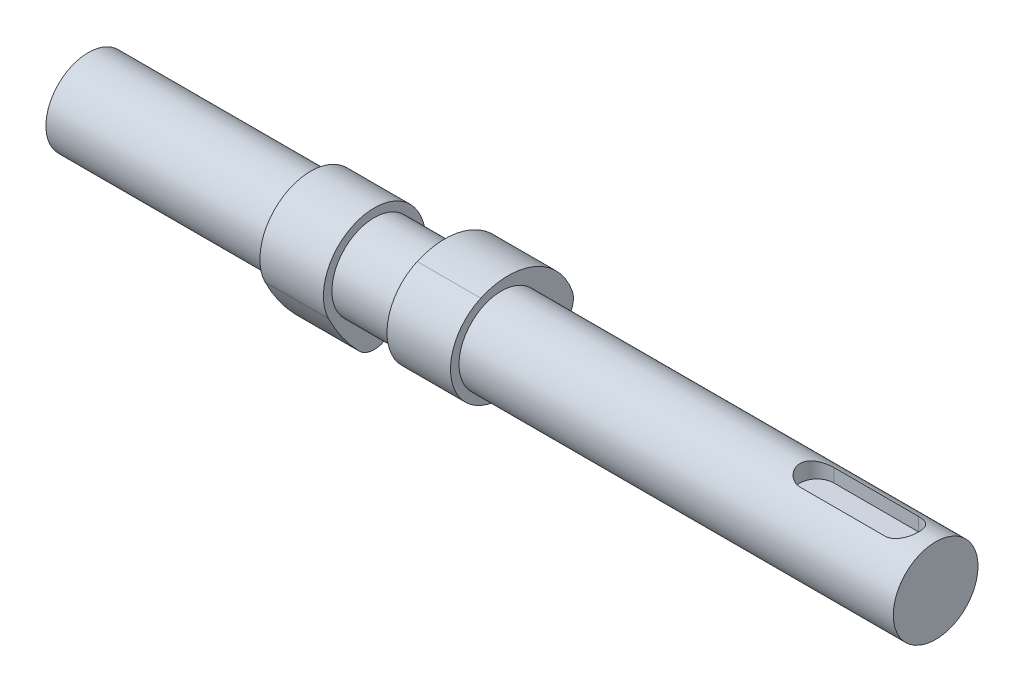
ISO-10303-21;
HEADER;
FILE_DESCRIPTION(('STEP AP214'),'2;1');
FILE_NAME('part.step','',(''),(''),'','','');
FILE_SCHEMA(('AUTOMOTIVE_DESIGN { 1 0 10303 214 1 1 1 1 }'));
ENDSEC;
DATA;
#1=APPLICATION_CONTEXT('core data for automotive mechanical design processes');
#2=APPLICATION_PROTOCOL_DEFINITION('international standard','automotive_design',2000,#1);
#3=PRODUCT_CONTEXT('',#1,'mechanical');
#4=PRODUCT('Part','Part','',(#3));
#5=PRODUCT_RELATED_PRODUCT_CATEGORY('part','',(#4));
#6=PRODUCT_DEFINITION_FORMATION('','',#4);
#7=PRODUCT_DEFINITION_CONTEXT('part definition',#1,'design');
#8=PRODUCT_DEFINITION('design','',#6,#7);
#9=PRODUCT_DEFINITION_SHAPE('','',#8);
#10=(LENGTH_UNIT() NAMED_UNIT(*) SI_UNIT(.MILLI.,.METRE.));
#11=(NAMED_UNIT(*) PLANE_ANGLE_UNIT() SI_UNIT($,.RADIAN.));
#12=(NAMED_UNIT(*) SI_UNIT($,.STERADIAN.) SOLID_ANGLE_UNIT());
#13=UNCERTAINTY_MEASURE_WITH_UNIT(LENGTH_MEASURE(1.E-05),#10,'distance_accuracy_value','');
#14=(GEOMETRIC_REPRESENTATION_CONTEXT(3) GLOBAL_UNCERTAINTY_ASSIGNED_CONTEXT((#13)) GLOBAL_UNIT_ASSIGNED_CONTEXT((#10,
#11,#12)) REPRESENTATION_CONTEXT('',''));
#15=CARTESIAN_POINT('',(0.,0.,0.));
#16=DIRECTION('',(0.,0.,1.));
#17=DIRECTION('',(1.,0.,0.));
#18=AXIS2_PLACEMENT_3D('',#15,#16,#17);
#19=CARTESIAN_POINT('',(-22.5,-1.62236318948022,3.65621904177246));
#20=DIRECTION('',(1.,0.,0.));
#21=DIRECTION('',(0.,1.,0.));
#22=AXIS2_PLACEMENT_3D('',#19,#20,#21);
#23=CYLINDRICAL_SURFACE('',#22,16.);
#24=CARTESIAN_POINT('',(-7.5,-1.62236318948022,3.65621904177246));
#25=DIRECTION('',(1.,0.,0.));
#26=DIRECTION('',(0.,1.,0.));
#27=AXIS2_PLACEMENT_3D('',#24,#25,#26);
#28=CIRCLE('',#27,16.);
#29=CARTESIAN_POINT('',(-7.5,-16.7126720366766,-1.66191774626015));
#30=VERTEX_POINT('',#29);
#31=CARTESIAN_POINT('',(-7.5,4.86708956844067,-10.9686571253174));
#32=VERTEX_POINT('',#31);
#33=EDGE_CURVE('E115',#30,#32,#28,.T.);
#34=ORIENTED_EDGE('',*,*,#33,.F.);
#35=DIRECTION('',(1.,0.,0.));
#36=VECTOR('',#35,1.);
#37=CARTESIAN_POINT('',(-22.5,-16.7126720366766,-1.66191774626015));
#38=LINE('',#37,#36);
#39=CARTESIAN_POINT('',(-22.5,-16.7126720366766,-1.66191774626015));
#40=VERTEX_POINT('',#39);
#41=EDGE_CURVE('E114',#40,#30,#38,.T.);
#42=ORIENTED_EDGE('',*,*,#41,.F.);
#43=CARTESIAN_POINT('',(-22.5,-1.62236318948022,3.65621904177246));
#44=DIRECTION('',(1.,0.,0.));
#45=DIRECTION('',(0.,1.,0.));
#46=AXIS2_PLACEMENT_3D('',#43,#44,#45);
#47=CIRCLE('',#46,16.);
#48=CARTESIAN_POINT('',(-22.5,4.86708956844067,-10.9686571253174));
#49=VERTEX_POINT('',#48);
#50=EDGE_CURVE('E109',#40,#49,#47,.T.);
#51=ORIENTED_EDGE('',*,*,#50,.T.);
#52=DIRECTION('',(1.,0.,0.));
#53=VECTOR('',#52,1.);
#54=CARTESIAN_POINT('',(-22.5,4.86708956844067,-10.9686571253174));
#55=LINE('',#54,#53);
#56=EDGE_CURVE('E12',#49,#32,#55,.T.);
#57=ORIENTED_EDGE('',*,*,#56,.T.);
#58=EDGE_LOOP('',(#34,#42,#51,#57));
#59=FACE_BOUND('',#58,.T.);
#60=ADVANCED_FACE('F52',(#59),#23,.T.);
#61=CARTESIAN_POINT('',(-22.5,0.,0.));
#62=DIRECTION('',(1.,0.,0.));
#63=DIRECTION('',(0.,1.,0.));
#64=AXIS2_PLACEMENT_3D('',#61,#62,#63);
#65=CYLINDRICAL_SURFACE('',#64,12.);
#66=CARTESIAN_POINT('',(-7.5,0.,0.));
#67=DIRECTION('',(1.,0.,0.));
#68=DIRECTION('',(0.,-1.,0.));
#69=AXIS2_PLACEMENT_3D('',#66,#67,#68);
#70=CIRCLE('',#69,12.);
#71=CARTESIAN_POINT('',(-7.5,-5.30622661682885,10.7630831591537));
#72=VERTEX_POINT('',#71);
#73=EDGE_CURVE('E117',#32,#72,#70,.T.);
#74=ORIENTED_EDGE('',*,*,#73,.F.);
#75=ORIENTED_EDGE('',*,*,#56,.F.);
#76=CARTESIAN_POINT('',(-22.5,0.,0.));
#77=DIRECTION('',(1.,0.,0.));
#78=DIRECTION('',(0.,-1.,0.));
#79=AXIS2_PLACEMENT_3D('',#76,#77,#78);
#80=CIRCLE('',#79,12.);
#81=CARTESIAN_POINT('',(-22.5,-5.30622661682885,10.7630831591537));
#82=VERTEX_POINT('',#81);
#83=EDGE_CURVE('E93',#49,#82,#80,.T.);
#84=ORIENTED_EDGE('',*,*,#83,.T.);
#85=DIRECTION('',(1.,0.,0.));
#86=VECTOR('',#85,1.);
#87=CARTESIAN_POINT('',(-22.5,-5.30622661682885,10.7630831591537));
#88=LINE('',#87,#86);
#89=EDGE_CURVE('E60',#82,#72,#88,.T.);
#90=ORIENTED_EDGE('',*,*,#89,.T.);
#91=EDGE_LOOP('',(#74,#75,#84,#90));
#92=FACE_BOUND('',#91,.T.);
#93=ADVANCED_FACE('F107',(#92),#65,.T.);
#94=CARTESIAN_POINT('',(-22.5,12.3811954392673,-25.1138607046918));
#95=DIRECTION('',(1.,0.,0.));
#96=DIRECTION('',(0.,1.,0.));
#97=AXIS2_PLACEMENT_3D('',#94,#95,#96);
#98=CYLINDRICAL_SURFACE('',#97,40.);
#99=CARTESIAN_POINT('',(-7.5,12.3811954392673,-25.1138607046918));
#100=DIRECTION('',(1.,0.,0.));
#101=DIRECTION('',(0.,-1.,0.));
#102=AXIS2_PLACEMENT_3D('',#99,#100,#101);
#103=CIRCLE('',#102,40.);
#104=CARTESIAN_POINT('',(-7.5,-15.4795428020985,3.58769438638461));
#105=VERTEX_POINT('',#104);
#106=EDGE_CURVE('E103',#72,#105,#103,.T.);
#107=ORIENTED_EDGE('',*,*,#106,.F.);
#108=ORIENTED_EDGE('',*,*,#89,.F.);
#109=CARTESIAN_POINT('',(-22.5,12.3811954392673,-25.1138607046918));
#110=DIRECTION('',(1.,0.,0.));
#111=DIRECTION('',(0.,-1.,0.));
#112=AXIS2_PLACEMENT_3D('',#109,#110,#111);
#113=CIRCLE('',#112,40.);
#114=CARTESIAN_POINT('',(-22.5,-15.4795428020985,3.58769438638461));
#115=VERTEX_POINT('',#114);
#116=EDGE_CURVE('E96',#82,#115,#113,.T.);
#117=ORIENTED_EDGE('',*,*,#116,.T.);
#118=DIRECTION('',(1.,0.,0.));
#119=VECTOR('',#118,1.);
#120=CARTESIAN_POINT('',(-22.5,-15.4795428020985,3.58769438638461));
#121=LINE('',#120,#119);
#122=EDGE_CURVE('E106',#115,#105,#121,.T.);
#123=ORIENTED_EDGE('',*,*,#122,.T.);
#124=EDGE_LOOP('',(#107,#108,#117,#123));
#125=FACE_BOUND('',#124,.T.);
#126=ADVANCED_FACE('F102',(#125),#98,.T.);
#127=CARTESIAN_POINT('',(-22.5,-11.9969505219278,0.));
#128=DIRECTION('',(1.,0.,0.));
#129=DIRECTION('',(0.,1.,0.));
#130=AXIS2_PLACEMENT_3D('',#127,#128,#129);
#131=CYLINDRICAL_SURFACE('',#130,5.);
#132=CARTESIAN_POINT('',(-7.5,-11.9969505219278,0.));
#133=DIRECTION('',(1.,0.,0.));
#134=DIRECTION('',(0.,-1.,0.));
#135=AXIS2_PLACEMENT_3D('',#132,#133,#134);
#136=CIRCLE('',#135,5.);
#137=EDGE_CURVE('E82',#105,#30,#136,.T.);
#138=ORIENTED_EDGE('',*,*,#137,.F.);
#139=ORIENTED_EDGE('',*,*,#122,.F.);
#140=CARTESIAN_POINT('',(-22.5,-11.9969505219278,0.));
#141=DIRECTION('',(1.,0.,0.));
#142=DIRECTION('',(0.,-1.,0.));
#143=AXIS2_PLACEMENT_3D('',#140,#141,#142);
#144=CIRCLE('',#143,5.);
#145=EDGE_CURVE('E68',#115,#40,#144,.T.);
#146=ORIENTED_EDGE('',*,*,#145,.T.);
#147=ORIENTED_EDGE('',*,*,#41,.T.);
#148=EDGE_LOOP('',(#138,#139,#146,#147));
#149=FACE_BOUND('',#148,.T.);
#150=ADVANCED_FACE('F126',(#149),#131,.T.);
#151=CARTESIAN_POINT('',(-22.5,-6.80965685570399,1.82810952088625));
#152=DIRECTION('',(1.,0.,0.));
#153=DIRECTION('',(0.,1.,0.));
#154=AXIS2_PLACEMENT_3D('',#151,#152,#153);
#155=PLANE('',#154);
#156=ORIENTED_EDGE('',*,*,#50,.F.);
#157=ORIENTED_EDGE('',*,*,#145,.F.);
#158=ORIENTED_EDGE('',*,*,#116,.F.);
#159=ORIENTED_EDGE('',*,*,#83,.F.);
#160=EDGE_LOOP('',(#156,#157,#158,#159));
#161=FACE_BOUND('',#160,.T.);
#162=ADVANCED_FACE('F98',(#161),#155,.F.);
#163=CARTESIAN_POINT('',(-7.5,-6.80965685570399,1.82810952088625));
#164=DIRECTION('',(1.,0.,0.));
#165=DIRECTION('',(0.,1.,0.));
#166=AXIS2_PLACEMENT_3D('',#163,#164,#165);
#167=PLANE('',#166);
#168=ORIENTED_EDGE('',*,*,#33,.T.);
#169=ORIENTED_EDGE('',*,*,#73,.T.);
#170=ORIENTED_EDGE('',*,*,#106,.T.);
#171=ORIENTED_EDGE('',*,*,#137,.T.);
#172=EDGE_LOOP('',(#168,#169,#170,#171));
#173=FACE_BOUND('',#172,.T.);
#174=ADVANCED_FACE('F122',(#173),#167,.T.);
#175=CLOSED_SHELL('',(#60,#93,#126,#150,#162,#174));
#176=MANIFOLD_SOLID_BREP('B2',#175);
#177=CARTESIAN_POINT('',(22.5,-3.65621904177246,-1.62236318948023));
#178=DIRECTION('',(-1.,0.,0.));
#179=DIRECTION('',(0.,0.,1.));
#180=AXIS2_PLACEMENT_3D('',#177,#178,#179);
#181=CYLINDRICAL_SURFACE('',#180,16.);
#182=CARTESIAN_POINT('',(7.5,-3.65621904177246,-1.62236318948023));
#183=DIRECTION('',(1.,0.,0.));
#184=DIRECTION('',(0.,0.,1.));
#185=AXIS2_PLACEMENT_3D('',#182,#183,#184);
#186=CIRCLE('',#185,16.);
#187=CARTESIAN_POINT('',(7.5,1.66191774626021,-16.7126720366766));
#188=VERTEX_POINT('',#187);
#189=CARTESIAN_POINT('',(7.5,10.9686571253174,4.8670895684407));
#190=VERTEX_POINT('',#189);
#191=EDGE_CURVE('E248',#188,#190,#186,.T.);
#192=ORIENTED_EDGE('',*,*,#191,.T.);
#193=DIRECTION('',(-1.,0.,0.));
#194=VECTOR('',#193,1.);
#195=CARTESIAN_POINT('',(22.5,10.9686571253174,4.8670895684407));
#196=LINE('',#195,#194);
#197=CARTESIAN_POINT('',(22.5,10.9686571253174,4.8670895684407));
#198=VERTEX_POINT('',#197);
#199=EDGE_CURVE('E50',#198,#190,#196,.T.);
#200=ORIENTED_EDGE('',*,*,#199,.F.);
#201=CARTESIAN_POINT('',(22.5,-3.65621904177246,-1.62236318948023));
#202=DIRECTION('',(1.,0.,0.));
#203=DIRECTION('',(0.,0.,1.));
#204=AXIS2_PLACEMENT_3D('',#201,#202,#203);
#205=CIRCLE('',#204,16.);
#206=CARTESIAN_POINT('',(22.5,1.66191774626021,-16.7126720366766));
#207=VERTEX_POINT('',#206);
#208=EDGE_CURVE('E236',#207,#198,#205,.T.);
#209=ORIENTED_EDGE('',*,*,#208,.F.);
#210=DIRECTION('',(-1.,0.,0.));
#211=VECTOR('',#210,1.);
#212=CARTESIAN_POINT('',(22.5,1.66191774626021,-16.7126720366766));
#213=LINE('',#212,#211);
#214=EDGE_CURVE('E244',#207,#188,#213,.T.);
#215=ORIENTED_EDGE('',*,*,#214,.T.);
#216=EDGE_LOOP('',(#192,#200,#209,#215));
#217=FACE_BOUND('',#216,.T.);
#218=ADVANCED_FACE('F185',(#217),#181,.T.);
#219=CARTESIAN_POINT('',(22.5,0.,0.));
#220=DIRECTION('',(-1.,0.,0.));
#221=DIRECTION('',(0.,0.,1.));
#222=AXIS2_PLACEMENT_3D('',#219,#220,#221);
#223=CYLINDRICAL_SURFACE('',#222,12.);
#224=CARTESIAN_POINT('',(7.5,0.,0.));
#225=DIRECTION('',(1.,0.,0.));
#226=DIRECTION('',(0.,0.,-1.));
#227=AXIS2_PLACEMENT_3D('',#224,#225,#226);
#228=CIRCLE('',#227,12.);
#229=CARTESIAN_POINT('',(7.5,-10.7630831591536,-5.30622661682889));
#230=VERTEX_POINT('',#229);
#231=EDGE_CURVE('E240',#190,#230,#228,.T.);
#232=ORIENTED_EDGE('',*,*,#231,.T.);
#233=DIRECTION('',(-1.,0.,0.));
#234=VECTOR('',#233,1.);
#235=CARTESIAN_POINT('',(22.5,-10.7630831591536,-5.30622661682889));
#236=LINE('',#235,#234);
#237=CARTESIAN_POINT('',(22.5,-10.7630831591536,-5.30622661682889));
#238=VERTEX_POINT('',#237);
#239=EDGE_CURVE('E193',#238,#230,#236,.T.);
#240=ORIENTED_EDGE('',*,*,#239,.F.);
#241=CARTESIAN_POINT('',(22.5,0.,0.));
#242=DIRECTION('',(1.,0.,0.));
#243=DIRECTION('',(0.,0.,-1.));
#244=AXIS2_PLACEMENT_3D('',#241,#242,#243);
#245=CIRCLE('',#244,12.);
#246=EDGE_CURVE('E231',#198,#238,#245,.T.);
#247=ORIENTED_EDGE('',*,*,#246,.F.);
#248=ORIENTED_EDGE('',*,*,#199,.T.);
#249=EDGE_LOOP('',(#232,#240,#247,#248));
#250=FACE_BOUND('',#249,.T.);
#251=ADVANCED_FACE('F239',(#250),#223,.T.);
#252=CARTESIAN_POINT('',(22.5,25.1138607046918,12.3811954392674));
#253=DIRECTION('',(-1.,0.,0.));
#254=DIRECTION('',(0.,0.,1.));
#255=AXIS2_PLACEMENT_3D('',#252,#253,#254);
#256=CYLINDRICAL_SURFACE('',#255,40.);
#257=CARTESIAN_POINT('',(7.5,25.1138607046918,12.3811954392674));
#258=DIRECTION('',(1.,0.,0.));
#259=DIRECTION('',(0.,0.,-1.));
#260=AXIS2_PLACEMENT_3D('',#257,#258,#259);
#261=CIRCLE('',#260,40.);
#262=CARTESIAN_POINT('',(7.5,-3.58769438638456,-15.4795428020985));
#263=VERTEX_POINT('',#262);
#264=EDGE_CURVE('E218',#230,#263,#261,.T.);
#265=ORIENTED_EDGE('',*,*,#264,.T.);
#266=DIRECTION('',(-1.,0.,0.));
#267=VECTOR('',#266,1.);
#268=CARTESIAN_POINT('',(22.5,-3.58769438638456,-15.4795428020985));
#269=LINE('',#268,#267);
#270=CARTESIAN_POINT('',(22.5,-3.58769438638456,-15.4795428020985));
#271=VERTEX_POINT('',#270);
#272=EDGE_CURVE('E241',#271,#263,#269,.T.);
#273=ORIENTED_EDGE('',*,*,#272,.F.);
#274=CARTESIAN_POINT('',(22.5,25.1138607046918,12.3811954392674));
#275=DIRECTION('',(1.,0.,0.));
#276=DIRECTION('',(0.,0.,-1.));
#277=AXIS2_PLACEMENT_3D('',#274,#275,#276);
#278=CIRCLE('',#277,40.);
#279=EDGE_CURVE('E234',#238,#271,#278,.T.);
#280=ORIENTED_EDGE('',*,*,#279,.F.);
#281=ORIENTED_EDGE('',*,*,#239,.T.);
#282=EDGE_LOOP('',(#265,#273,#280,#281));
#283=FACE_BOUND('',#282,.T.);
#284=ADVANCED_FACE('F242',(#283),#256,.T.);
#285=CARTESIAN_POINT('',(22.5,0.,-11.9969505219278));
#286=DIRECTION('',(-1.,0.,0.));
#287=DIRECTION('',(0.,0.,1.));
#288=AXIS2_PLACEMENT_3D('',#285,#286,#287);
#289=CYLINDRICAL_SURFACE('',#288,5.);
#290=CARTESIAN_POINT('',(7.5,0.,-11.9969505219278));
#291=DIRECTION('',(1.,0.,0.));
#292=DIRECTION('',(0.,0.,-1.));
#293=AXIS2_PLACEMENT_3D('',#290,#291,#292);
#294=CIRCLE('',#293,5.);
#295=EDGE_CURVE('E224',#263,#188,#294,.T.);
#296=ORIENTED_EDGE('',*,*,#295,.T.);
#297=ORIENTED_EDGE('',*,*,#214,.F.);
#298=CARTESIAN_POINT('',(22.5,0.,-11.9969505219278));
#299=DIRECTION('',(1.,0.,0.));
#300=DIRECTION('',(0.,0.,-1.));
#301=AXIS2_PLACEMENT_3D('',#298,#299,#300);
#302=CIRCLE('',#301,5.);
#303=EDGE_CURVE('E201',#271,#207,#302,.T.);
#304=ORIENTED_EDGE('',*,*,#303,.F.);
#305=ORIENTED_EDGE('',*,*,#272,.T.);
#306=EDGE_LOOP('',(#296,#297,#304,#305));
#307=FACE_BOUND('',#306,.T.);
#308=ADVANCED_FACE('F255',(#307),#289,.T.);
#309=CARTESIAN_POINT('',(22.5,-1.82810952088623,-6.80965685570399));
#310=DIRECTION('',(-1.,0.,0.));
#311=DIRECTION('',(0.,0.,1.));
#312=AXIS2_PLACEMENT_3D('',#309,#310,#311);
#313=PLANE('',#312);
#314=ORIENTED_EDGE('',*,*,#208,.T.);
#315=ORIENTED_EDGE('',*,*,#246,.T.);
#316=ORIENTED_EDGE('',*,*,#279,.T.);
#317=ORIENTED_EDGE('',*,*,#303,.T.);
#318=EDGE_LOOP('',(#314,#315,#316,#317));
#319=FACE_BOUND('',#318,.T.);
#320=ADVANCED_FACE('F232',(#319),#313,.F.);
#321=CARTESIAN_POINT('',(7.5,-1.82810952088623,-6.80965685570399));
#322=DIRECTION('',(-1.,0.,0.));
#323=DIRECTION('',(0.,0.,1.));
#324=AXIS2_PLACEMENT_3D('',#321,#322,#323);
#325=PLANE('',#324);
#326=ORIENTED_EDGE('',*,*,#191,.F.);
#327=ORIENTED_EDGE('',*,*,#295,.F.);
#328=ORIENTED_EDGE('',*,*,#264,.F.);
#329=ORIENTED_EDGE('',*,*,#231,.F.);
#330=EDGE_LOOP('',(#326,#327,#328,#329));
#331=FACE_BOUND('',#330,.T.);
#332=ADVANCED_FACE('F258',(#331),#325,.T.);
#333=CLOSED_SHELL('',(#218,#251,#284,#308,#320,#332));
#334=MANIFOLD_SOLID_BREP('B6',#333);
#335=CARTESIAN_POINT('',(125.,0.,0.));
#336=DIRECTION('',(-1.,0.,0.));
#337=DIRECTION('',(0.,0.,1.));
#338=AXIS2_PLACEMENT_3D('',#335,#336,#337);
#339=CYLINDRICAL_SURFACE('',#338,10.);
#340=DIRECTION('',(-1.,0.,0.));
#341=VECTOR('',#340,1.);
#342=CARTESIAN_POINT('',(125.,9.16515138991168,4.));
#343=LINE('',#342,#341);
#344=CARTESIAN_POINT('',(117.,9.16515138991168,4.));
#345=VERTEX_POINT('',#344);
#346=CARTESIAN_POINT('',(97.,9.16515138991168,4.));
#347=VERTEX_POINT('',#346);
#348=EDGE_CURVE('E183',#345,#347,#343,.T.);
#349=ORIENTED_EDGE('',*,*,#348,.T.);
#350=CARTESIAN_POINT('',(97.,9.16515138991168,4.));
#351=CARTESIAN_POINT('',(96.8923882949458,9.16512928809544,4.00001596071938));
#352=CARTESIAN_POINT('',(96.7847886688333,9.16704612011428,3.99565782731266));
#353=CARTESIAN_POINT('',(96.5704574034612,9.17459250745478,3.9783181194646));
#354=CARTESIAN_POINT('',(96.4637254492831,9.18022064873058,3.96533982937531));
#355=CARTESIAN_POINT('',(96.2523063568937,9.19499565865171,3.93095207352899));
#356=CARTESIAN_POINT('',(96.1476128319149,9.20412861441611,3.90957593640916));
#357=CARTESIAN_POINT('',(95.9405984565681,9.22560106586818,3.85863260381273));
#358=CARTESIAN_POINT('',(95.8382777514449,9.23794075728508,3.82906490834148));
#359=CARTESIAN_POINT('',(95.5361282988375,9.2791858250141,3.72853943587112));
#360=CARTESIAN_POINT('',(95.3406915386172,9.3123489831615,3.64568978920222));
#361=CARTESIAN_POINT('',(94.9664088398381,9.38624741529469,3.45096383184147));
#362=CARTESIAN_POINT('',(94.7875788940914,9.42698987727426,3.33905992673094));
#363=CARTESIAN_POINT('',(94.441475206636,9.51401998804847,3.08263671474506));
#364=CARTESIAN_POINT('',(94.2752655660996,9.56048491272144,2.93673827988501));
#365=CARTESIAN_POINT('',(93.9689194556385,9.65225581096199,2.61939292349379));
#366=CARTESIAN_POINT('',(93.8287883384928,9.69756154495612,2.44794076987999));
#367=CARTESIAN_POINT('',(93.5731872113755,9.78406834216144,2.07601181629754));
#368=CARTESIAN_POINT('',(93.4589103805898,9.82503649102096,1.87465586655104));
#369=CARTESIAN_POINT('',(93.2663118555086,9.89607888234979,1.45364828604454));
#370=CARTESIAN_POINT('',(93.1879751552067,9.92615767032247,1.23400433637532));
#371=CARTESIAN_POINT('',(93.0733175942291,9.97076629361036,0.79393488418738));
#372=CARTESIAN_POINT('',(93.0351460866969,9.98597845290694,0.574062114869031));
#373=CARTESIAN_POINT('',(92.9959430515965,10.001606202074,0.130536855092213));
#374=CARTESIAN_POINT('',(92.9948983667482,10.0020270338048,-0.0931142682526716));
#375=CARTESIAN_POINT('',(93.0289656379282,9.98843920775428,-0.524466731987226));
#376=CARTESIAN_POINT('',(93.0620499465532,9.97523973659777,-0.732358330632746));
#377=CARTESIAN_POINT('',(93.1599870009102,9.93698538393897,-1.13934964738688));
#378=CARTESIAN_POINT('',(93.2248415445704,9.91192983148495,-1.33844886722558));
#379=CARTESIAN_POINT('',(93.3852720377719,9.85193670608706,-1.72579479688348));
#380=CARTESIAN_POINT('',(93.481296395839,9.81685584875391,-1.91383264586891));
#381=CARTESIAN_POINT('',(93.7009312637048,9.74029168639969,-2.2716159956307));
#382=CARTESIAN_POINT('',(93.8245514514378,9.69880613681324,-2.4413550479227));
#383=CARTESIAN_POINT('',(94.1052800574364,9.61043706268122,-2.7695225783069));
#384=CARTESIAN_POINT('',(94.2640530171164,9.56337795745419,-2.92647922614483));
#385=CARTESIAN_POINT('',(94.6059921366628,9.47123359153046,-3.2122147086262));
#386=CARTESIAN_POINT('',(94.7891693487996,9.42614923753061,-3.34098070594789));
#387=CARTESIAN_POINT('',(95.0816356456234,9.36326134539255,-3.51186134851388));
#388=CARTESIAN_POINT('',(95.1836718383149,9.34283170142195,-3.56571263251515));
#389=CARTESIAN_POINT('',(95.3923923024092,9.30450957703985,-3.66454761505659));
#390=CARTESIAN_POINT('',(95.4990745457273,9.28661600381593,-3.70953513634086));
#391=CARTESIAN_POINT('',(95.7162289304962,9.25400250539921,-3.79016254319007));
#392=CARTESIAN_POINT('',(95.8266961700413,9.23927864276951,-3.82581403809398));
#393=CARTESIAN_POINT('',(96.0506683681487,9.2135146773091,-3.88744848158463));
#394=CARTESIAN_POINT('',(96.1641719402125,9.20247292309662,-3.91343576505911));
#395=CARTESIAN_POINT('',(96.3974454473375,9.18417798205495,-3.95619393609845));
#396=CARTESIAN_POINT('',(96.5172941945638,9.17707470750587,-3.97260125584169));
#397=CARTESIAN_POINT('',(96.758090929137,9.16754485606458,-3.99451448409732));
#398=CARTESIAN_POINT('',(96.8790381929227,9.16511539745838,-4.0000271099601));
#399=CARTESIAN_POINT('',(97.,9.16515138991168,-4.));
#400=B_SPLINE_CURVE_WITH_KNOTS('',3,(#350,#351,#352,#353,#354,#355,#356,#357,#358,#359,#360,
#361,#362,#363,#364,#365,#366,#367,#368,#369,#370,#371,#372,#373,#374,#375,#376,#377,#378,#379,
#380,#381,#382,#383,#384,#385,#386,#387,#388,#389,#390,#391,#392,#393,#394,#395,#396,#397,#398,
#399),.UNSPECIFIED.,.F.,.F.,(4,2,2,2,2,2,2,2,2,2,2,2,2,2,2,2,2,2,2,2,2,2,2,2,4),(0.,
0.322709706217834,0.645296527806424,0.966615822543774,1.28795473422461,1.9293660035182,
2.57138869889252,3.24636095994995,3.92147161082381,4.62325717855526,5.32474946398644,
5.99227753012539,6.65956903033311,7.2893783052307,7.91922322615308,8.55856353859093,
9.19812842270037,9.87963749353246,10.5614562641081,10.9125878460839,11.2635676597187,
11.6141089352909,11.964492785171,12.3274303244848,12.6901440171997),.UNSPECIFIED.);
#401=CARTESIAN_POINT('',(97.,9.16515138991168,-4.));
#402=VERTEX_POINT('',#401);
#403=EDGE_CURVE('E395',#347,#402,#400,.T.);
#404=ORIENTED_EDGE('',*,*,#403,.T.);
#405=DIRECTION('',(-1.,0.,0.));
#406=VECTOR('',#405,1.);
#407=CARTESIAN_POINT('',(125.,9.16515138991168,-4.));
#408=LINE('',#407,#406);
#409=CARTESIAN_POINT('',(117.,9.16515138991168,-4.));
#410=VERTEX_POINT('',#409);
#411=EDGE_CURVE('E318',#402,#410,#408,.F.);
#412=ORIENTED_EDGE('',*,*,#411,.T.);
#413=CARTESIAN_POINT('',(117.,9.16515138991168,-4.));
#414=CARTESIAN_POINT('',(117.107611705054,9.16512928809544,-4.00001596071937));
#415=CARTESIAN_POINT('',(117.215211331167,9.16704612011429,-3.99565782731265));
#416=CARTESIAN_POINT('',(117.429542596539,9.17459250745478,-3.97831811946459));
#417=CARTESIAN_POINT('',(117.536274550717,9.18022064873058,-3.96533982937531));
#418=CARTESIAN_POINT('',(117.747693643106,9.19499565865171,-3.93095207352899));
#419=CARTESIAN_POINT('',(117.852387168085,9.20412861441611,-3.90957593640916));
#420=CARTESIAN_POINT('',(118.059401543432,9.22560106586818,-3.85863260381273));
#421=CARTESIAN_POINT('',(118.161722248555,9.23794075728508,-3.82906490834148));
#422=CARTESIAN_POINT('',(118.463871701162,9.2791858250141,-3.72853943587112));
#423=CARTESIAN_POINT('',(118.659308461383,9.3123489831615,-3.64568978920222));
#424=CARTESIAN_POINT('',(119.033591160162,9.38624741529469,-3.45096383184147));
#425=CARTESIAN_POINT('',(119.212421105909,9.42698987727425,-3.33905992673094));
#426=CARTESIAN_POINT('',(119.558524793364,9.51401998804847,-3.08263671474506));
#427=CARTESIAN_POINT('',(119.7247344339,9.56048491272144,-2.93673827988501));
#428=CARTESIAN_POINT('',(120.031080544362,9.65225581096199,-2.61939292349378));
#429=CARTESIAN_POINT('',(120.171211661507,9.69756154495612,-2.44794076987998));
#430=CARTESIAN_POINT('',(120.426812788624,9.78406834216145,-2.07601181629754));
#431=CARTESIAN_POINT('',(120.54108961941,9.82503649102096,-1.87465586655103));
#432=CARTESIAN_POINT('',(120.733688144491,9.89607888234979,-1.45364828604453));
#433=CARTESIAN_POINT('',(120.812024844793,9.92615767032247,-1.23400433637531));
#434=CARTESIAN_POINT('',(120.926682405771,9.97076629361036,-0.793934884187374));
#435=CARTESIAN_POINT('',(120.964853913303,9.98597845290694,-0.574062114869026));
#436=CARTESIAN_POINT('',(121.004056948403,10.001606202074,-0.130536855092209));
#437=CARTESIAN_POINT('',(121.005101633252,10.0020270338048,0.0931142682526744));
#438=CARTESIAN_POINT('',(120.971034362072,9.98843920775428,0.52446673198723));
#439=CARTESIAN_POINT('',(120.937950053447,9.97523973659777,0.732358330632752));
#440=CARTESIAN_POINT('',(120.84001299909,9.93698538393897,1.13934964738688));
#441=CARTESIAN_POINT('',(120.77515845543,9.91192983148495,1.33844886722558));
#442=CARTESIAN_POINT('',(120.614727962228,9.85193670608706,1.72579479688349));
#443=CARTESIAN_POINT('',(120.518703604161,9.81685584875391,1.91383264586892));
#444=CARTESIAN_POINT('',(120.299068736295,9.74029168639969,2.27161599563071));
#445=CARTESIAN_POINT('',(120.175448548562,9.69880613681324,2.4413550479227));
#446=CARTESIAN_POINT('',(119.894719942564,9.61043706268122,2.7695225783069));
#447=CARTESIAN_POINT('',(119.735946982884,9.56337795745419,2.92647922614483));
#448=CARTESIAN_POINT('',(119.394007863337,9.47123359153046,3.2122147086262));
#449=CARTESIAN_POINT('',(119.2108306512,9.42614923753061,3.34098070594789));
#450=CARTESIAN_POINT('',(118.918364354377,9.36326134539254,3.51186134851389));
#451=CARTESIAN_POINT('',(118.816328161685,9.34283170142194,3.56571263251515));
#452=CARTESIAN_POINT('',(118.607607697591,9.30450957703985,3.66454761505659));
#453=CARTESIAN_POINT('',(118.500925454273,9.28661600381593,3.70953513634086));
#454=CARTESIAN_POINT('',(118.283771069504,9.25400250539921,3.79016254319007));
#455=CARTESIAN_POINT('',(118.173303829959,9.23927864276951,3.82581403809398));
#456=CARTESIAN_POINT('',(117.949331631851,9.2135146773091,3.88744848158463));
#457=CARTESIAN_POINT('',(117.835828059787,9.20247292309662,3.91343576505912));
#458=CARTESIAN_POINT('',(117.602554552662,9.18417798205495,3.95619393609845));
#459=CARTESIAN_POINT('',(117.482705805436,9.17707470750587,3.9726012558417));
#460=CARTESIAN_POINT('',(117.241909070863,9.16754485606458,3.99451448409732));
#461=CARTESIAN_POINT('',(117.120961807077,9.16511539745838,4.0000271099601));
#462=CARTESIAN_POINT('',(117.,9.16515138991168,4.));
#463=B_SPLINE_CURVE_WITH_KNOTS('',3,(#413,#414,#415,#416,#417,#418,#419,#420,#421,#422,#423,
#424,#425,#426,#427,#428,#429,#430,#431,#432,#433,#434,#435,#436,#437,#438,#439,#440,#441,#442,
#443,#444,#445,#446,#447,#448,#449,#450,#451,#452,#453,#454,#455,#456,#457,#458,#459,#460,#461,
#462),.UNSPECIFIED.,.F.,.F.,(4,2,2,2,2,2,2,2,2,2,2,2,2,2,2,2,2,2,2,2,2,2,2,2,4),(0.,
0.322709706217834,0.645296527806424,0.966615822543774,1.28795473422461,1.92936600351818,
2.5713886988925,3.24636095994996,3.92147161082381,4.62325717855526,5.32474946398644,
5.99227753012539,6.65956903033311,7.2893783052307,7.91922322615308,8.55856353859093,
9.19812842270038,9.87963749353244,10.5614562641081,10.9125878460839,11.2635676597187,
11.6141089352909,11.964492785171,12.3274303244848,12.6901440171997),.UNSPECIFIED.);
#464=EDGE_CURVE('E325',#410,#345,#463,.T.);
#465=ORIENTED_EDGE('',*,*,#464,.T.);
#466=EDGE_LOOP('',(#349,#404,#412,#465));
#467=FACE_BOUND('',#466,.T.);
#468=CARTESIAN_POINT('',(125.,0.,0.));
#469=DIRECTION('',(1.,0.,0.));
#470=DIRECTION('',(0.,0.,-1.));
#471=AXIS2_PLACEMENT_3D('',#468,#469,#470);
#472=CIRCLE('',#471,10.);
#473=CARTESIAN_POINT('',(125.,0.,-10.));
#474=VERTEX_POINT('',#473);
#475=EDGE_CURVE('E391',#474,#474,#472,.T.);
#476=ORIENTED_EDGE('',*,*,#475,.F.);
#477=EDGE_LOOP('',(#476));
#478=FACE_BOUND('',#477,.T.);
#479=CARTESIAN_POINT('',(-75.,0.,0.));
#480=DIRECTION('',(1.,0.,0.));
#481=DIRECTION('',(0.,0.,-1.));
#482=AXIS2_PLACEMENT_3D('',#479,#480,#481);
#483=CIRCLE('',#482,10.);
#484=CARTESIAN_POINT('',(-75.,0.,-10.));
#485=VERTEX_POINT('',#484);
#486=EDGE_CURVE('E382',#485,#485,#483,.T.);
#487=ORIENTED_EDGE('',*,*,#486,.T.);
#488=EDGE_LOOP('',(#487));
#489=FACE_BOUND('',#488,.T.);
#490=ADVANCED_FACE('F309',(#467,#478,#489),#339,.T.);
#491=CARTESIAN_POINT('',(125.,0.,0.));
#492=DIRECTION('',(1.,0.,0.));
#493=DIRECTION('',(0.,0.,-1.));
#494=AXIS2_PLACEMENT_3D('',#491,#492,#493);
#495=PLANE('',#494);
#496=ORIENTED_EDGE('',*,*,#475,.T.);
#497=EDGE_LOOP('',(#496));
#498=FACE_BOUND('',#497,.T.);
#499=ADVANCED_FACE('F423',(#498),#495,.T.);
#500=CARTESIAN_POINT('',(-75.,0.,0.));
#501=DIRECTION('',(1.,0.,0.));
#502=DIRECTION('',(0.,0.,-1.));
#503=AXIS2_PLACEMENT_3D('',#500,#501,#502);
#504=PLANE('',#503);
#505=ORIENTED_EDGE('',*,*,#486,.F.);
#506=EDGE_LOOP('',(#505));
#507=FACE_BOUND('',#506,.T.);
#508=ADVANCED_FACE('F421',(#507),#504,.F.);
#509=CARTESIAN_POINT('',(117.,6.,0.));
#510=DIRECTION('',(0.,1.,0.));
#511=DIRECTION('',(0.,0.,1.));
#512=AXIS2_PLACEMENT_3D('',#509,#510,#511);
#513=CYLINDRICAL_SURFACE('',#512,4.);
#514=DIRECTION('',(0.,1.,0.));
#515=VECTOR('',#514,1.);
#516=CARTESIAN_POINT('',(117.,6.,-4.));
#517=LINE('',#516,#515);
#518=CARTESIAN_POINT('',(117.,6.,-4.));
#519=VERTEX_POINT('',#518);
#520=EDGE_CURVE('E348',#519,#410,#517,.T.);
#521=ORIENTED_EDGE('',*,*,#520,.F.);
#522=CARTESIAN_POINT('',(117.,6.,0.));
#523=DIRECTION('',(0.,1.,0.));
#524=DIRECTION('',(0.,0.,1.));
#525=AXIS2_PLACEMENT_3D('',#522,#523,#524);
#526=CIRCLE('',#525,4.);
#527=CARTESIAN_POINT('',(117.,6.,4.));
#528=VERTEX_POINT('',#527);
#529=EDGE_CURVE('E352',#528,#519,#526,.T.);
#530=ORIENTED_EDGE('',*,*,#529,.F.);
#531=DIRECTION('',(0.,1.,0.));
#532=VECTOR('',#531,1.);
#533=CARTESIAN_POINT('',(117.,6.,4.));
#534=LINE('',#533,#532);
#535=EDGE_CURVE('E379',#528,#345,#534,.T.);
#536=ORIENTED_EDGE('',*,*,#535,.T.);
#537=ORIENTED_EDGE('',*,*,#464,.F.);
#538=EDGE_LOOP('',(#521,#530,#536,#537));
#539=FACE_BOUND('',#538,.T.);
#540=ADVANCED_FACE('F350',(#539),#513,.F.);
#541=CARTESIAN_POINT('',(117.,6.,4.));
#542=DIRECTION('',(0.,0.,1.));
#543=DIRECTION('',(1.,0.,0.));
#544=AXIS2_PLACEMENT_3D('',#541,#542,#543);
#545=PLANE('',#544);
#546=ORIENTED_EDGE('',*,*,#535,.F.);
#547=DIRECTION('',(1.,0.,0.));
#548=VECTOR('',#547,1.);
#549=CARTESIAN_POINT('',(117.,6.,4.));
#550=LINE('',#549,#548);
#551=CARTESIAN_POINT('',(97.,6.,4.));
#552=VERTEX_POINT('',#551);
#553=EDGE_CURVE('E358',#552,#528,#550,.T.);
#554=ORIENTED_EDGE('',*,*,#553,.F.);
#555=DIRECTION('',(0.,1.,0.));
#556=VECTOR('',#555,1.);
#557=CARTESIAN_POINT('',(97.,6.,4.));
#558=LINE('',#557,#556);
#559=EDGE_CURVE('E383',#552,#347,#558,.T.);
#560=ORIENTED_EDGE('',*,*,#559,.T.);
#561=ORIENTED_EDGE('',*,*,#348,.F.);
#562=EDGE_LOOP('',(#546,#554,#560,#561));
#563=FACE_BOUND('',#562,.T.);
#564=ADVANCED_FACE('F414',(#563),#545,.F.);
#565=CARTESIAN_POINT('',(97.,6.,0.));
#566=DIRECTION('',(0.,1.,0.));
#567=DIRECTION('',(0.,0.,1.));
#568=AXIS2_PLACEMENT_3D('',#565,#566,#567);
#569=CYLINDRICAL_SURFACE('',#568,4.);
#570=ORIENTED_EDGE('',*,*,#559,.F.);
#571=CARTESIAN_POINT('',(97.,6.,0.));
#572=DIRECTION('',(0.,1.,0.));
#573=DIRECTION('',(0.,0.,1.));
#574=AXIS2_PLACEMENT_3D('',#571,#572,#573);
#575=CIRCLE('',#574,4.);
#576=CARTESIAN_POINT('',(97.,6.,-4.));
#577=VERTEX_POINT('',#576);
#578=EDGE_CURVE('E368',#577,#552,#575,.T.);
#579=ORIENTED_EDGE('',*,*,#578,.F.);
#580=DIRECTION('',(0.,1.,0.));
#581=VECTOR('',#580,1.);
#582=CARTESIAN_POINT('',(97.,6.,-4.));
#583=LINE('',#582,#581);
#584=EDGE_CURVE('E357',#577,#402,#583,.T.);
#585=ORIENTED_EDGE('',*,*,#584,.T.);
#586=ORIENTED_EDGE('',*,*,#403,.F.);
#587=EDGE_LOOP('',(#570,#579,#585,#586));
#588=FACE_BOUND('',#587,.T.);
#589=ADVANCED_FACE('F409',(#588),#569,.F.);
#590=CARTESIAN_POINT('',(117.,6.,-4.));
#591=DIRECTION('',(0.,0.,-1.));
#592=DIRECTION('',(-1.,0.,0.));
#593=AXIS2_PLACEMENT_3D('',#590,#591,#592);
#594=PLANE('',#593);
#595=ORIENTED_EDGE('',*,*,#584,.F.);
#596=DIRECTION('',(-1.,0.,0.));
#597=VECTOR('',#596,1.);
#598=CARTESIAN_POINT('',(117.,6.,-4.));
#599=LINE('',#598,#597);
#600=EDGE_CURVE('E361',#519,#577,#599,.T.);
#601=ORIENTED_EDGE('',*,*,#600,.F.);
#602=ORIENTED_EDGE('',*,*,#520,.T.);
#603=ORIENTED_EDGE('',*,*,#411,.F.);
#604=EDGE_LOOP('',(#595,#601,#602,#603));
#605=FACE_BOUND('',#604,.T.);
#606=ADVANCED_FACE('F362',(#605),#594,.F.);
#607=CARTESIAN_POINT('',(117.,6.,0.));
#608=DIRECTION('',(0.,1.,0.));
#609=DIRECTION('',(0.,0.,1.));
#610=AXIS2_PLACEMENT_3D('',#607,#608,#609);
#611=PLANE('',#610);
#612=ORIENTED_EDGE('',*,*,#529,.T.);
#613=ORIENTED_EDGE('',*,*,#600,.T.);
#614=ORIENTED_EDGE('',*,*,#578,.T.);
#615=ORIENTED_EDGE('',*,*,#553,.T.);
#616=EDGE_LOOP('',(#612,#613,#614,#615));
#617=FACE_BOUND('',#616,.T.);
#618=ADVANCED_FACE('F370',(#617),#611,.T.);
#619=CLOSED_SHELL('',(#490,#499,#508,#540,#564,#589,#606,#618));
#620=MANIFOLD_SOLID_BREP('B44',#619);
#621=ADVANCED_BREP_SHAPE_REPRESENTATION('',(#18,#176,#334,#620),#14);
#622=SHAPE_DEFINITION_REPRESENTATION(#9,#621);
ENDSEC;
END-ISO-10303-21;
